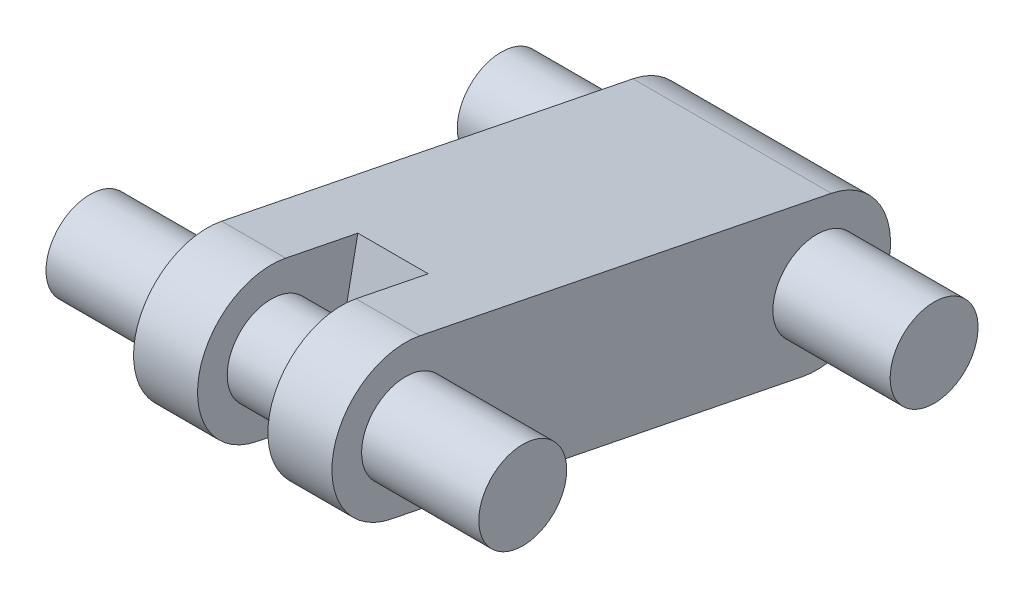
ISO-10303-21;
HEADER;
FILE_DESCRIPTION(('STEP AP214'),'2;1');
FILE_NAME('part.step','',(''),(''),'','','');
FILE_SCHEMA(('AUTOMOTIVE_DESIGN { 1 0 10303 214 1 1 1 1 }'));
ENDSEC;
DATA;
#1=APPLICATION_CONTEXT('core data for automotive mechanical design processes');
#2=APPLICATION_PROTOCOL_DEFINITION('international standard','automotive_design',2000,#1);
#3=PRODUCT_CONTEXT('',#1,'mechanical');
#4=PRODUCT('Part','Part','',(#3));
#5=PRODUCT_RELATED_PRODUCT_CATEGORY('part','',(#4));
#6=PRODUCT_DEFINITION_FORMATION('','',#4);
#7=PRODUCT_DEFINITION_CONTEXT('part definition',#1,'design');
#8=PRODUCT_DEFINITION('design','',#6,#7);
#9=PRODUCT_DEFINITION_SHAPE('','',#8);
#10=(LENGTH_UNIT() NAMED_UNIT(*) SI_UNIT(.MILLI.,.METRE.));
#11=(NAMED_UNIT(*) PLANE_ANGLE_UNIT() SI_UNIT($,.RADIAN.));
#12=(NAMED_UNIT(*) SI_UNIT($,.STERADIAN.) SOLID_ANGLE_UNIT());
#13=UNCERTAINTY_MEASURE_WITH_UNIT(LENGTH_MEASURE(1.E-05),#10,'distance_accuracy_value','');
#14=(GEOMETRIC_REPRESENTATION_CONTEXT(3) GLOBAL_UNCERTAINTY_ASSIGNED_CONTEXT((#13)) GLOBAL_UNIT_ASSIGNED_CONTEXT((#10,
#11,#12)) REPRESENTATION_CONTEXT('',''));
#15=CARTESIAN_POINT('',(0.,0.,0.));
#16=DIRECTION('',(0.,0.,1.));
#17=DIRECTION('',(1.,0.,0.));
#18=AXIS2_PLACEMENT_3D('',#15,#16,#17);
#19=CARTESIAN_POINT('',(1630.79999999997,5550.11623001144,-4431.25255969045));
#20=DIRECTION('',(-1.,5.89388367211985E-12,-4.95878464606059E-13));
#21=DIRECTION('',(-5.91470684821287E-12,-0.996457640382185,0.0840962004133861));
#22=AXIS2_PLACEMENT_3D('',#19,#20,#21);
#23=PLANE('',#22);
#24=CARTESIAN_POINT('',(1630.79999999997,5550.11623001144,-4431.25255969045));
#25=DIRECTION('',(-1.,5.89388367211985E-12,-4.95878461217928E-13));
#26=DIRECTION('',(-5.91470684821287E-12,-0.996457640382185,0.0840962004133862));
#27=AXIS2_PLACEMENT_3D('',#24,#25,#26);
#28=CIRCLE('',#27,74.9999999999992);
#29=CARTESIAN_POINT('',(1630.79999999952,5475.38190698278,-4424.94534465945));
#30=VERTEX_POINT('',#29);
#31=EDGE_CURVE('E19',#30,#30,#28,.F.);
#32=ORIENTED_EDGE('',*,*,#31,.F.);
#33=EDGE_LOOP('',(#32));
#34=FACE_BOUND('',#33,.T.);
#35=ADVANCED_FACE('F16',(#34),#23,.T.);
#36=CARTESIAN_POINT('',(1630.79999999994,5409.66183838425,-5132.95482379213));
#37=DIRECTION('',(-1.,5.89388434974621E-12,-4.95878522204298E-13));
#38=DIRECTION('',(-5.91470755294428E-12,-0.996457640382185,0.0840962004133861));
#39=AXIS2_PLACEMENT_3D('',#36,#37,#38);
#40=PLANE('',#39);
#41=CARTESIAN_POINT('',(1630.79999999994,5409.66183838425,-5132.95482379213));
#42=DIRECTION('',(-1.,5.89388434974621E-12,-4.95878522204298E-13));
#43=DIRECTION('',(-5.91470755294428E-12,-0.996457640382185,0.0840962004133862));
#44=AXIS2_PLACEMENT_3D('',#41,#42,#43);
#45=CIRCLE('',#44,74.9999999999992);
#46=CARTESIAN_POINT('',(1630.7999999995,5334.92751535558,-5126.64760876113));
#47=VERTEX_POINT('',#46);
#48=EDGE_CURVE('E166',#47,#47,#45,.F.);
#49=ORIENTED_EDGE('',*,*,#48,.F.);
#50=EDGE_LOOP('',(#49));
#51=FACE_BOUND('',#50,.T.);
#52=ADVANCED_FACE('F176',(#51),#40,.T.);
#53=CARTESIAN_POINT('',(2369.20000000041,5624.85055303576,-4437.55977472109));
#54=DIRECTION('',(1.,-5.88484773710222E-12,4.97344216323672E-13));
#55=DIRECTION('',(5.90582620242815E-12,0.996457640382185,-0.0840962004133861));
#56=AXIS2_PLACEMENT_3D('',#53,#54,#55);
#57=PLANE('',#56);
#58=CARTESIAN_POINT('',(2369.19999999997,5550.1162300071,-4431.25255969009));
#59=DIRECTION('',(-1.,5.88484773710222E-12,-4.9734421293554E-13));
#60=DIRECTION('',(-5.90582620242815E-12,-0.996457640382185,0.0840962004133862));
#61=AXIS2_PLACEMENT_3D('',#58,#59,#60);
#62=CIRCLE('',#61,74.9999999999992);
#63=CARTESIAN_POINT('',(2369.19999999952,5475.38190697843,-4424.94534465908));
#64=VERTEX_POINT('',#63);
#65=EDGE_CURVE('E164',#64,#64,#62,.T.);
#66=ORIENTED_EDGE('',*,*,#65,.F.);
#67=EDGE_LOOP('',(#66));
#68=FACE_BOUND('',#67,.T.);
#69=ADVANCED_FACE('F181',(#68),#57,.T.);
#70=CARTESIAN_POINT('',(2369.20000000038,5484.39616140856,-5139.26203882277));
#71=DIRECTION('',(1.,-5.88484803525782E-12,4.97344240040593E-13));
#72=DIRECTION('',(5.90582650058374E-12,0.996457640382185,-0.0840962004133861));
#73=AXIS2_PLACEMENT_3D('',#70,#71,#72);
#74=PLANE('',#73);
#75=CARTESIAN_POINT('',(2369.19999999994,5409.6618383799,-5132.95482379176));
#76=DIRECTION('',(-1.,5.88484803525782E-12,-4.97344240040594E-13));
#77=DIRECTION('',(-5.90582650058374E-12,-0.996457640382185,0.0840962004133862));
#78=AXIS2_PLACEMENT_3D('',#75,#76,#77);
#79=CIRCLE('',#78,74.9999999999992);
#80=CARTESIAN_POINT('',(2369.1999999995,5334.92751535124,-5126.64760876076));
#81=VERTEX_POINT('',#80);
#82=EDGE_CURVE('E129',#81,#81,#79,.T.);
#83=ORIENTED_EDGE('',*,*,#82,.F.);
#84=EDGE_LOOP('',(#83));
#85=FACE_BOUND('',#84,.T.);
#86=ADVANCED_FACE('F237',(#85),#74,.T.);
#87=CARTESIAN_POINT('',(2059.99999995257,5550.11623000931,-4431.25255969027));
#88=DIRECTION('',(-1.,0.,0.));
#89=DIRECTION('',(0.,-0.996457640382185,0.0840962004133862));
#90=AXIS2_PLACEMENT_3D('',#87,#88,#89);
#91=CYLINDRICAL_SURFACE('',#90,75.0000000007079);
#92=CARTESIAN_POINT('',(1940.00000004736,5550.11623000931,-4431.25255969027));
#93=DIRECTION('',(-1.,0.,0.));
#94=DIRECTION('',(0.,-0.996457640382185,0.0840962004133862));
#95=AXIS2_PLACEMENT_3D('',#92,#93,#94);
#96=CIRCLE('',#95,75.0000000007079);
#97=CARTESIAN_POINT('',(1940.00000004736,5475.38190697994,-4424.94534465921));
#98=VERTEX_POINT('',#97);
#99=EDGE_CURVE('E105',#98,#98,#96,.F.);
#100=ORIENTED_EDGE('',*,*,#99,.T.);
#101=EDGE_LOOP('',(#100));
#102=FACE_BOUND('',#101,.T.);
#103=CARTESIAN_POINT('',(2059.99999995346,5550.11623000931,-4431.25255969027));
#104=DIRECTION('',(-1.,0.,0.));
#105=DIRECTION('',(0.,-0.996457640382185,0.0840962004133862));
#106=AXIS2_PLACEMENT_3D('',#103,#104,#105);
#107=CIRCLE('',#106,75.0000000007079);
#108=CARTESIAN_POINT('',(2059.99999995346,5475.38190697994,-4424.94534465921));
#109=VERTEX_POINT('',#108);
#110=EDGE_CURVE('E101',#109,#109,#107,.T.);
#111=ORIENTED_EDGE('',*,*,#110,.T.);
#112=EDGE_LOOP('',(#111));
#113=FACE_BOUND('',#112,.T.);
#114=ADVANCED_FACE('F233',(#102,#113),#91,.T.);
#115=CARTESIAN_POINT('',(1830.79998931664,5550.11623001027,-4431.25255969035));
#116=DIRECTION('',(-1.,5.89388367211985E-12,-4.95878461217928E-13));
#117=DIRECTION('',(-5.91470684821287E-12,-0.996457640382185,0.0840962004133862));
#118=AXIS2_PLACEMENT_3D('',#115,#116,#117);
#119=CYLINDRICAL_SURFACE('',#118,74.9999999999992);
#120=CARTESIAN_POINT('',(1830.79999999996,5550.11623001027,-4431.25255969035));
#121=DIRECTION('',(-1.,5.89388367211985E-12,-4.95878461217928E-13));
#122=DIRECTION('',(-5.91470684821287E-12,-0.996457640382185,0.0840962004133862));
#123=AXIS2_PLACEMENT_3D('',#120,#121,#122);
#124=CIRCLE('',#123,74.9999999999992);
#125=CARTESIAN_POINT('',(1830.79999999952,5475.3819069816,-4424.94534465935));
#126=VERTEX_POINT('',#125);
#127=EDGE_CURVE('E131',#126,#126,#124,.F.);
#128=ORIENTED_EDGE('',*,*,#127,.F.);
#129=EDGE_LOOP('',(#128));
#130=FACE_BOUND('',#129,.T.);
#131=ORIENTED_EDGE('',*,*,#31,.T.);
#132=EDGE_LOOP('',(#131));
#133=FACE_BOUND('',#132,.T.);
#134=ADVANCED_FACE('F173',(#130,#133),#119,.T.);
#135=CARTESIAN_POINT('',(1830.79998931662,5409.66183838307,-5132.95482379203));
#136=DIRECTION('',(-1.,5.89388434974621E-12,-4.95878522204298E-13));
#137=DIRECTION('',(-5.91470755294428E-12,-0.996457640382185,0.0840962004133862));
#138=AXIS2_PLACEMENT_3D('',#135,#136,#137);
#139=CYLINDRICAL_SURFACE('',#138,74.9999999999992);
#140=CARTESIAN_POINT('',(1830.79999999994,5409.66183838307,-5132.95482379203));
#141=DIRECTION('',(-1.,5.89388434974621E-12,-4.95878522204298E-13));
#142=DIRECTION('',(-5.91470755294428E-12,-0.996457640382185,0.0840962004133862));
#143=AXIS2_PLACEMENT_3D('',#140,#141,#142);
#144=CIRCLE('',#143,74.9999999999992);
#145=CARTESIAN_POINT('',(1830.7999999995,5334.92751535441,-5126.64760876103));
#146=VERTEX_POINT('',#145);
#147=EDGE_CURVE('E152',#146,#146,#144,.F.);
#148=ORIENTED_EDGE('',*,*,#147,.F.);
#149=EDGE_LOOP('',(#148));
#150=FACE_BOUND('',#149,.T.);
#151=ORIENTED_EDGE('',*,*,#48,.T.);
#152=EDGE_LOOP('',(#151));
#153=FACE_BOUND('',#152,.T.);
#154=ADVANCED_FACE('F226',(#150,#153),#139,.T.);
#155=CARTESIAN_POINT('',(2369.19998931664,5550.1162300071,-4431.25255969009));
#156=DIRECTION('',(-1.,5.88484773710222E-12,-4.9734421293554E-13));
#157=DIRECTION('',(-5.90582620242815E-12,-0.996457640382185,0.0840962004133862));
#158=AXIS2_PLACEMENT_3D('',#155,#156,#157);
#159=CYLINDRICAL_SURFACE('',#158,74.9999999999992);
#160=CARTESIAN_POINT('',(2169.19999999997,5550.11623000827,-4431.25255969018));
#161=DIRECTION('',(-1.,5.88484773710222E-12,-4.9734421293554E-13));
#162=DIRECTION('',(-5.90582620242815E-12,-0.996457640382185,0.0840962004133862));
#163=AXIS2_PLACEMENT_3D('',#160,#161,#162);
#164=CIRCLE('',#163,74.9999999999992);
#165=CARTESIAN_POINT('',(2169.19999999953,5475.38190697961,-4424.94534465918));
#166=VERTEX_POINT('',#165);
#167=EDGE_CURVE('E143',#166,#166,#164,.F.);
#168=ORIENTED_EDGE('',*,*,#167,.T.);
#169=EDGE_LOOP('',(#168));
#170=FACE_BOUND('',#169,.T.);
#171=ORIENTED_EDGE('',*,*,#65,.T.);
#172=EDGE_LOOP('',(#171));
#173=FACE_BOUND('',#172,.T.);
#174=ADVANCED_FACE('F222',(#170,#173),#159,.T.);
#175=CARTESIAN_POINT('',(2369.19998931662,5409.6618383799,-5132.95482379176));
#176=DIRECTION('',(-1.,5.88484803525782E-12,-4.97344240040594E-13));
#177=DIRECTION('',(-5.90582650058374E-12,-0.996457640382185,0.0840962004133862));
#178=AXIS2_PLACEMENT_3D('',#175,#176,#177);
#179=CYLINDRICAL_SURFACE('',#178,74.9999999999992);
#180=CARTESIAN_POINT('',(2169.19999999994,5409.66183838108,-5132.95482379186));
#181=DIRECTION('',(-1.,5.88484803525782E-12,-4.97344240040594E-13));
#182=DIRECTION('',(-5.90582650058374E-12,-0.996457640382185,0.0840962004133862));
#183=AXIS2_PLACEMENT_3D('',#180,#181,#182);
#184=CIRCLE('',#183,74.9999999999992);
#185=CARTESIAN_POINT('',(2169.1999999995,5334.92751535241,-5126.64760876086));
#186=VERTEX_POINT('',#185);
#187=EDGE_CURVE('E140',#186,#186,#184,.F.);
#188=ORIENTED_EDGE('',*,*,#187,.T.);
#189=EDGE_LOOP('',(#188));
#190=FACE_BOUND('',#189,.T.);
#191=ORIENTED_EDGE('',*,*,#82,.T.);
#192=EDGE_LOOP('',(#191));
#193=FACE_BOUND('',#192,.T.);
#194=ADVANCED_FACE('F219',(#190,#193),#179,.T.);
#195=CARTESIAN_POINT('',(2169.20000000071,5673.29488777995,-4455.9082923617));
#196=DIRECTION('',(5.94915198887099E-12,0.98055004514853,-0.196269225705959));
#197=DIRECTION('',(-2.6142816249298E-05,0.196269225638889,0.980550044813453));
#198=AXIS2_PLACEMENT_3D('',#195,#196,#197);
#199=PLANE('',#198);
#200=DIRECTION('',(0.,-0.196269225705958,-0.98055004514853));
#201=VECTOR('',#200,1.);
#202=CARTESIAN_POINT('',(1940.00000004886,5673.2948877813,-4455.90829236193));
#203=LINE('',#202,#201);
#204=CARTESIAN_POINT('',(1940.00000004886,5673.2948877813,-4455.90829236194));
#205=VERTEX_POINT('',#204);
#206=CARTESIAN_POINT('',(1940.00000004885,5648.63915510965,-4579.08695013362));
#207=VERTEX_POINT('',#206);
#208=EDGE_CURVE('E88',#205,#207,#203,.T.);
#209=ORIENTED_EDGE('',*,*,#208,.T.);
#210=DIRECTION('',(1.,-5.85193857631865E-12,1.12147311539158E-12));
#211=VECTOR('',#210,1.);
#212=CARTESIAN_POINT('',(1940.00000004885,5648.63915510965,-4579.08695013362));
#213=LINE('',#212,#211);
#214=CARTESIAN_POINT('',(2059.99999995256,5648.63915510895,-4579.08695013349));
#215=VERTEX_POINT('',#214);
#216=EDGE_CURVE('E103',#207,#215,#213,.T.);
#217=ORIENTED_EDGE('',*,*,#216,.T.);
#218=DIRECTION('',(0.,0.196269225705968,0.980550045148528));
#219=VECTOR('',#218,1.);
#220=CARTESIAN_POINT('',(2059.99999995256,5648.63915510895,-4579.08695013349));
#221=LINE('',#220,#219);
#222=CARTESIAN_POINT('',(2059.99999995257,5673.29488778059,-4455.90829236181));
#223=VERTEX_POINT('',#222);
#224=EDGE_CURVE('E92',#215,#223,#221,.T.);
#225=ORIENTED_EDGE('',*,*,#224,.T.);
#226=DIRECTION('',(-1.,5.83992736715853E-12,-1.13523146370156E-12));
#227=VECTOR('',#226,1.);
#228=CARTESIAN_POINT('',(2169.20000000071,5673.29488777996,-4455.9082923617));
#229=LINE('',#228,#227);
#230=CARTESIAN_POINT('',(2169.20000000071,5673.29488777995,-4455.90829236169));
#231=VERTEX_POINT('',#230);
#232=EDGE_CURVE('E120',#231,#223,#229,.T.);
#233=ORIENTED_EDGE('',*,*,#232,.F.);
#234=DIRECTION('',(0.,-0.196269225705959,-0.98055004514853));
#235=VECTOR('',#234,1.);
#236=CARTESIAN_POINT('',(2169.20000000071,5673.29488777995,-4455.9082923617));
#237=LINE('',#236,#235);
#238=CARTESIAN_POINT('',(2169.20000000069,5532.84049615276,-5157.61055646337));
#239=VERTEX_POINT('',#238);
#240=EDGE_CURVE('E139',#231,#239,#237,.T.);
#241=ORIENTED_EDGE('',*,*,#240,.T.);
#242=DIRECTION('',(-1.,5.84144395137632E-12,-1.13657562296254E-12));
#243=VECTOR('',#242,1.);
#244=CARTESIAN_POINT('',(2169.20000000069,5532.84049615276,-5157.61055646337));
#245=LINE('',#244,#243);
#246=CARTESIAN_POINT('',(1830.80000000069,5532.84049615473,-5157.61055646376));
#247=VERTEX_POINT('',#246);
#248=EDGE_CURVE('E126',#239,#247,#245,.T.);
#249=ORIENTED_EDGE('',*,*,#248,.T.);
#250=DIRECTION('',(0.,-0.196269225705959,-0.98055004514853));
#251=VECTOR('',#250,1.);
#252=CARTESIAN_POINT('',(1830.80000000071,5673.29488778193,-4455.90829236208));
#253=LINE('',#252,#251);
#254=CARTESIAN_POINT('',(1830.80000000071,5673.29488778193,-4455.90829236206));
#255=VERTEX_POINT('',#254);
#256=EDGE_CURVE('E148',#255,#247,#253,.T.);
#257=ORIENTED_EDGE('',*,*,#256,.F.);
#258=DIRECTION('',(-1.,5.83992736715853E-12,-1.13523146370156E-12));
#259=VECTOR('',#258,1.);
#260=CARTESIAN_POINT('',(2169.20000000071,5673.29488777996,-4455.90829236167));
#261=LINE('',#260,#259);
#262=EDGE_CURVE('E130',#205,#255,#261,.T.);
#263=ORIENTED_EDGE('',*,*,#262,.F.);
#264=EDGE_LOOP('',(#209,#217,#225,#233,#241,#249,#257,#263));
#265=FACE_BOUND('',#264,.T.);
#266=ADVANCED_FACE('F104',(#265),#199,.T.);
#267=CARTESIAN_POINT('',(2059.99999995312,5740.72051499969,-4597.51817380955));
#268=DIRECTION('',(1.,-5.84106210486562E-12,1.12956278317438E-12));
#269=DIRECTION('',(5.91536284473733E-12,0.996457640382185,-0.0840962004133861));
#270=AXIS2_PLACEMENT_3D('',#267,#268,#269);
#271=PLANE('',#270);
#272=ORIENTED_EDGE('',*,*,#224,.F.);
#273=DIRECTION('',(-5.94897260762156E-12,-0.980550045148528,0.196269225705966));
#274=VECTOR('',#273,1.);
#275=CARTESIAN_POINT('',(2059.99999995256,5648.63915510895,-4579.08695013349));
#276=LINE('',#275,#274);
#277=CARTESIAN_POINT('',(2059.99999995107,5402.28183956565,-4529.77548479022));
#278=VERTEX_POINT('',#277);
#279=EDGE_CURVE('E96',#215,#278,#276,.T.);
#280=ORIENTED_EDGE('',*,*,#279,.T.);
#281=DIRECTION('',(0.,-0.19626922570596,-0.980550045148529));
#282=VECTOR('',#281,1.);
#283=CARTESIAN_POINT('',(2059.99999995107,5426.9375722373,-4406.59682701853));
#284=LINE('',#283,#282);
#285=CARTESIAN_POINT('',(2059.99999995107,5426.9375722373,-4406.59682701853));
#286=VERTEX_POINT('',#285);
#287=EDGE_CURVE('E118',#286,#278,#284,.T.);
#288=ORIENTED_EDGE('',*,*,#287,.F.);
#289=CARTESIAN_POINT('',(2059.99999995182,5550.11623000894,-4431.25255969017));
#290=DIRECTION('',(-1.,5.83992736715853E-12,-1.13523146370156E-12));
#291=DIRECTION('',(-5.91470885398689E-12,-0.996457640382185,0.0840962004133862));
#292=AXIS2_PLACEMENT_3D('',#289,#290,#291);
#293=CIRCLE('',#292,125.622000000002);
#294=EDGE_CURVE('E98',#223,#286,#293,.F.);
#295=ORIENTED_EDGE('',*,*,#294,.F.);
#296=EDGE_LOOP('',(#272,#280,#288,#295));
#297=FACE_BOUND('',#296,.T.);
#298=ORIENTED_EDGE('',*,*,#110,.F.);
#299=EDGE_LOOP('',(#298));
#300=FACE_BOUND('',#299,.T.);
#301=ADVANCED_FACE('F93',(#297,#300),#271,.F.);
#302=CARTESIAN_POINT('',(1940.00000004941,5740.72051500039,-4597.51817380969));
#303=DIRECTION('',(0.,-0.196269225705965,-0.980550045148529));
#304=DIRECTION('',(-0.000229637020709085,0.980550019294776,-0.196269220531016));
#305=AXIS2_PLACEMENT_3D('',#302,#303,#304);
#306=PLANE('',#305);
#307=DIRECTION('',(-5.94916592086891E-12,-0.980550045148528,0.196269225705966));
#308=VECTOR('',#307,1.);
#309=CARTESIAN_POINT('',(1940.00000004885,5648.63915510965,-4579.08695013362));
#310=LINE('',#309,#308);
#311=CARTESIAN_POINT('',(1940.00000004736,5402.28183956635,-4529.77548479035));
#312=VERTEX_POINT('',#311);
#313=EDGE_CURVE('E80',#207,#312,#310,.T.);
#314=ORIENTED_EDGE('',*,*,#313,.T.);
#315=DIRECTION('',(-1.,5.82181518802031E-12,-1.12635864196017E-12));
#316=VECTOR('',#315,1.);
#317=CARTESIAN_POINT('',(2059.99999995107,5402.28183956565,-4529.77548479022));
#318=LINE('',#317,#316);
#319=EDGE_CURVE('E109',#278,#312,#318,.T.);
#320=ORIENTED_EDGE('',*,*,#319,.F.);
#321=ORIENTED_EDGE('',*,*,#279,.F.);
#322=ORIENTED_EDGE('',*,*,#216,.F.);
#323=EDGE_LOOP('',(#314,#320,#321,#322));
#324=FACE_BOUND('',#323,.T.);
#325=ADVANCED_FACE('F107',(#324),#306,.F.);
#326=CARTESIAN_POINT('',(1940.00000004943,5803.64874700288,-4283.13225564439));
#327=DIRECTION('',(-1.,5.84108759178826E-12,-1.12943545567463E-12));
#328=DIRECTION('',(-5.91537753567677E-12,-0.996457640382185,0.0840962004133861));
#329=AXIS2_PLACEMENT_3D('',#326,#327,#328);
#330=PLANE('',#329);
#331=DIRECTION('',(0.,0.196269225705978,0.980550045148526));
#332=VECTOR('',#331,1.);
#333=CARTESIAN_POINT('',(1940.00000004736,5402.28183956635,-4529.77548479035));
#334=LINE('',#333,#332);
#335=CARTESIAN_POINT('',(1940.00000004736,5426.937572238,-4406.59682701866));
#336=VERTEX_POINT('',#335);
#337=EDGE_CURVE('E378',#312,#336,#334,.T.);
#338=ORIENTED_EDGE('',*,*,#337,.F.);
#339=ORIENTED_EDGE('',*,*,#313,.F.);
#340=ORIENTED_EDGE('',*,*,#208,.F.);
#341=CARTESIAN_POINT('',(1940.00000004811,5550.11623000964,-4431.25255969031));
#342=DIRECTION('',(-1.,5.83992736715853E-12,-1.13523146370156E-12));
#343=DIRECTION('',(-5.91470885398689E-12,-0.996457640382185,0.0840962004133862));
#344=AXIS2_PLACEMENT_3D('',#341,#342,#343);
#345=CIRCLE('',#344,125.622000000002);
#346=EDGE_CURVE('E72',#336,#205,#345,.T.);
#347=ORIENTED_EDGE('',*,*,#346,.F.);
#348=EDGE_LOOP('',(#338,#339,#340,#347));
#349=FACE_BOUND('',#348,.T.);
#350=ORIENTED_EDGE('',*,*,#99,.F.);
#351=EDGE_LOOP('',(#350));
#352=FACE_BOUND('',#351,.T.);
#353=ADVANCED_FACE('F209',(#349,#352),#330,.F.);
#354=CARTESIAN_POINT('',(2169.19999999996,5550.11623000831,-4431.25255969005));
#355=DIRECTION('',(-1.,5.83992736715853E-12,-1.13523146370156E-12));
#356=DIRECTION('',(-5.91470885398689E-12,-0.996457640382185,0.0840962004133862));
#357=AXIS2_PLACEMENT_3D('',#354,#355,#356);
#358=CYLINDRICAL_SURFACE('',#357,125.622000000002);
#359=CARTESIAN_POINT('',(1830.79999999996,5550.11623001028,-4431.25255969043));
#360=DIRECTION('',(-1.,5.83992736715853E-12,-1.13523146370156E-12));
#361=DIRECTION('',(-5.91470885398689E-12,-0.996457640382185,0.0840962004133862));
#362=AXIS2_PLACEMENT_3D('',#359,#360,#361);
#363=CIRCLE('',#362,125.622000000002);
#364=CARTESIAN_POINT('',(1830.79999999922,5426.93757223863,-4406.5968270188));
#365=VERTEX_POINT('',#364);
#366=EDGE_CURVE('E149',#365,#255,#363,.T.);
#367=ORIENTED_EDGE('',*,*,#366,.F.);
#368=DIRECTION('',(-1.,5.78683961405759E-12,-1.33665000103265E-12));
#369=VECTOR('',#368,1.);
#370=CARTESIAN_POINT('',(1940.00000004736,5426.937572238,-4406.59682701865));
#371=LINE('',#370,#369);
#372=EDGE_CURVE('E380',#336,#365,#371,.T.);
#373=ORIENTED_EDGE('',*,*,#372,.F.);
#374=ORIENTED_EDGE('',*,*,#346,.T.);
#375=ORIENTED_EDGE('',*,*,#262,.T.);
#376=EDGE_LOOP('',(#367,#373,#374,#375));
#377=FACE_BOUND('',#376,.T.);
#378=ADVANCED_FACE('F205',(#377),#358,.T.);
#379=CARTESIAN_POINT('',(1830.79999999996,5550.11623001028,-4431.25255969043));
#380=DIRECTION('',(-1.,5.83992734005347E-12,-1.13523146370156E-12));
#381=DIRECTION('',(-5.91470882688183E-12,-0.996457640382185,0.0840962004133861));
#382=AXIS2_PLACEMENT_3D('',#379,#380,#381);
#383=PLANE('',#382);
#384=CARTESIAN_POINT('',(1830.79999999994,5409.66183838309,-5132.95482379212));
#385=DIRECTION('',(-1.,5.83992736715853E-12,-1.13523146370156E-12));
#386=DIRECTION('',(-5.91470885398689E-12,-0.996457640382185,0.0840962004133862));
#387=AXIS2_PLACEMENT_3D('',#384,#385,#386);
#388=CIRCLE('',#387,125.622000000003);
#389=CARTESIAN_POINT('',(1830.79999999919,5286.48318061143,-5108.29909112049));
#390=VERTEX_POINT('',#389);
#391=EDGE_CURVE('E146',#390,#247,#388,.F.);
#392=ORIENTED_EDGE('',*,*,#391,.F.);
#393=DIRECTION('',(0.,-0.196269225705962,-0.980550045148529));
#394=VECTOR('',#393,1.);
#395=CARTESIAN_POINT('',(1830.79999999922,5426.93757223863,-4406.5968270188));
#396=LINE('',#395,#394);
#397=EDGE_CURVE('E392',#365,#390,#396,.T.);
#398=ORIENTED_EDGE('',*,*,#397,.F.);
#399=ORIENTED_EDGE('',*,*,#366,.T.);
#400=ORIENTED_EDGE('',*,*,#256,.T.);
#401=EDGE_LOOP('',(#392,#398,#399,#400));
#402=FACE_BOUND('',#401,.T.);
#403=ORIENTED_EDGE('',*,*,#147,.T.);
#404=EDGE_LOOP('',(#403));
#405=FACE_BOUND('',#404,.T.);
#406=ORIENTED_EDGE('',*,*,#127,.T.);
#407=EDGE_LOOP('',(#406));
#408=FACE_BOUND('',#407,.T.);
#409=ADVANCED_FACE('F201',(#402,#405,#408),#383,.T.);
#410=CARTESIAN_POINT('',(2169.19999999994,5409.66183838111,-5132.95482379174));
#411=DIRECTION('',(-1.,5.83992736715853E-12,-1.13523146370156E-12));
#412=DIRECTION('',(-5.91470885398689E-12,-0.996457640382185,0.0840962004133862));
#413=AXIS2_PLACEMENT_3D('',#410,#411,#412);
#414=CYLINDRICAL_SURFACE('',#413,125.622000000003);
#415=DIRECTION('',(1.,-5.84166470079339E-12,1.13396028305182E-12));
#416=VECTOR('',#415,1.);
#417=CARTESIAN_POINT('',(1830.79999999919,5286.48318061143,-5108.29909112049));
#418=LINE('',#417,#416);
#419=CARTESIAN_POINT('',(2169.19999999919,5286.48318060946,-5108.2990911201));
#420=VERTEX_POINT('',#419);
#421=EDGE_CURVE('E396',#390,#420,#418,.T.);
#422=ORIENTED_EDGE('',*,*,#421,.F.);
#423=ORIENTED_EDGE('',*,*,#391,.T.);
#424=ORIENTED_EDGE('',*,*,#248,.F.);
#425=CARTESIAN_POINT('',(2169.19999999994,5409.66183838111,-5132.95482379174));
#426=DIRECTION('',(-1.,5.83992736715853E-12,-1.13523146370156E-12));
#427=DIRECTION('',(-5.91470885398689E-12,-0.996457640382185,0.0840962004133862));
#428=AXIS2_PLACEMENT_3D('',#425,#426,#427);
#429=CIRCLE('',#428,125.622000000003);
#430=EDGE_CURVE('E137',#239,#420,#429,.T.);
#431=ORIENTED_EDGE('',*,*,#430,.T.);
#432=EDGE_LOOP('',(#422,#423,#424,#431));
#433=FACE_BOUND('',#432,.T.);
#434=ADVANCED_FACE('F198',(#433),#414,.T.);
#435=CARTESIAN_POINT('',(2169.19999999996,5550.11623000831,-4431.25255969005));
#436=DIRECTION('',(-1.,5.83992734005347E-12,-1.13523146370156E-12));
#437=DIRECTION('',(-5.91470882688183E-12,-0.996457640382185,0.0840962004133861));
#438=AXIS2_PLACEMENT_3D('',#435,#436,#437);
#439=PLANE('',#438);
#440=DIRECTION('',(0.,0.196269225705965,0.980550045148529));
#441=VECTOR('',#440,1.);
#442=CARTESIAN_POINT('',(2169.19999999919,5286.48318060946,-5108.2990911201));
#443=LINE('',#442,#441);
#444=CARTESIAN_POINT('',(2169.19999999922,5426.93757223665,-4406.59682701841));
#445=VERTEX_POINT('',#444);
#446=EDGE_CURVE('E25',#420,#445,#443,.T.);
#447=ORIENTED_EDGE('',*,*,#446,.F.);
#448=ORIENTED_EDGE('',*,*,#430,.F.);
#449=ORIENTED_EDGE('',*,*,#240,.F.);
#450=CARTESIAN_POINT('',(2169.19999999996,5550.11623000831,-4431.25255969005));
#451=DIRECTION('',(-1.,5.83992736715853E-12,-1.13523146370156E-12));
#452=DIRECTION('',(-5.91470885398689E-12,-0.996457640382185,0.0840962004133862));
#453=AXIS2_PLACEMENT_3D('',#450,#451,#452);
#454=CIRCLE('',#453,125.622000000002);
#455=EDGE_CURVE('E34',#445,#231,#454,.T.);
#456=ORIENTED_EDGE('',*,*,#455,.F.);
#457=EDGE_LOOP('',(#447,#448,#449,#456));
#458=FACE_BOUND('',#457,.T.);
#459=ORIENTED_EDGE('',*,*,#187,.F.);
#460=EDGE_LOOP('',(#459));
#461=FACE_BOUND('',#460,.T.);
#462=ORIENTED_EDGE('',*,*,#167,.F.);
#463=EDGE_LOOP('',(#462));
#464=FACE_BOUND('',#463,.T.);
#465=ADVANCED_FACE('F191',(#458,#461,#464),#439,.F.);
#466=CARTESIAN_POINT('',(2169.19999999996,5550.11623000831,-4431.25255969005));
#467=DIRECTION('',(-1.,5.83992736715853E-12,-1.13523146370156E-12));
#468=DIRECTION('',(-5.91470885398689E-12,-0.996457640382185,0.0840962004133862));
#469=AXIS2_PLACEMENT_3D('',#466,#467,#468);
#470=CYLINDRICAL_SURFACE('',#469,125.622000000002);
#471=ORIENTED_EDGE('',*,*,#455,.T.);
#472=ORIENTED_EDGE('',*,*,#232,.T.);
#473=ORIENTED_EDGE('',*,*,#294,.T.);
#474=DIRECTION('',(-1.,5.86146632832361E-12,-1.03277631818054E-12));
#475=VECTOR('',#474,1.);
#476=CARTESIAN_POINT('',(2169.19999999922,5426.93757223665,-4406.59682701842));
#477=LINE('',#476,#475);
#478=EDGE_CURVE('E10',#445,#286,#477,.T.);
#479=ORIENTED_EDGE('',*,*,#478,.F.);
#480=EDGE_LOOP('',(#471,#472,#473,#479));
#481=FACE_BOUND('',#480,.T.);
#482=ADVANCED_FACE('F185',(#481),#470,.T.);
#483=CARTESIAN_POINT('',(2169.19999999919,5286.48318060946,-5108.2990911201));
#484=DIRECTION('',(-5.949151988871E-12,-0.980550045148529,0.196269225705965));
#485=DIRECTION('',(2.61428162492994E-05,-0.196269225638895,-0.980550044813452));
#486=AXIS2_PLACEMENT_3D('',#483,#484,#485);
#487=PLANE('',#486);
#488=ORIENTED_EDGE('',*,*,#446,.T.);
#489=ORIENTED_EDGE('',*,*,#478,.T.);
#490=ORIENTED_EDGE('',*,*,#287,.T.);
#491=ORIENTED_EDGE('',*,*,#319,.T.);
#492=ORIENTED_EDGE('',*,*,#337,.T.);
#493=ORIENTED_EDGE('',*,*,#372,.T.);
#494=ORIENTED_EDGE('',*,*,#397,.T.);
#495=ORIENTED_EDGE('',*,*,#421,.T.);
#496=EDGE_LOOP('',(#488,#489,#490,#491,#492,#493,#494,#495));
#497=FACE_BOUND('',#496,.T.);
#498=ADVANCED_FACE('F183',(#497),#487,.T.);
#499=CLOSED_SHELL('',(#35,#52,#69,#86,#114,#134,#154,#174,#194,#266,#301,#325,#353,#378,#409,
#434,#465,#482,#498));
#500=MANIFOLD_SOLID_BREP('B1',#499);
#501=ADVANCED_BREP_SHAPE_REPRESENTATION('',(#18,#500),#14);
#502=SHAPE_DEFINITION_REPRESENTATION(#9,#501);
ENDSEC;
END-ISO-10303-21;
